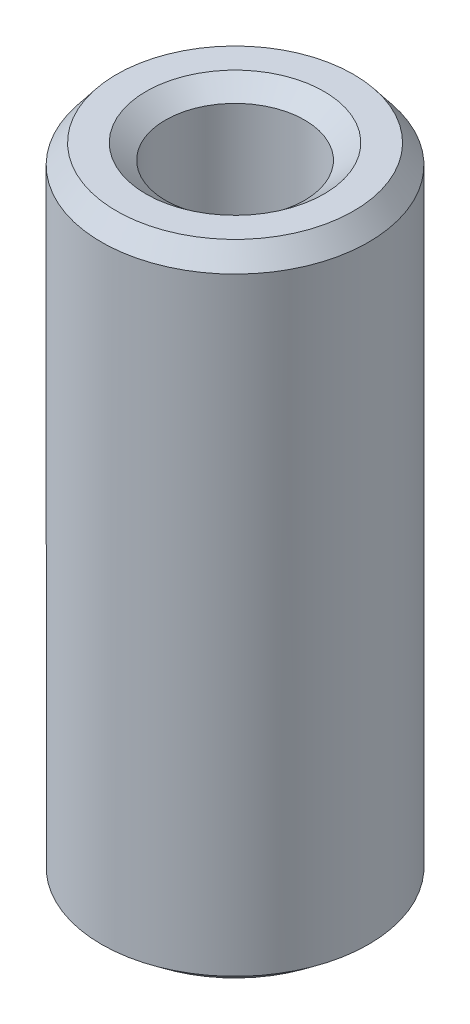
ISO-10303-21;
HEADER;
FILE_DESCRIPTION(('STEP AP214'),'2;1');
FILE_NAME('part.step','',(''),(''),'','','');
FILE_SCHEMA(('AUTOMOTIVE_DESIGN { 1 0 10303 214 1 1 1 1 }'));
ENDSEC;
DATA;
#1=APPLICATION_CONTEXT('core data for automotive mechanical design processes');
#2=APPLICATION_PROTOCOL_DEFINITION('international standard','automotive_design',2000,#1);
#3=PRODUCT_CONTEXT('',#1,'mechanical');
#4=PRODUCT('Part','Part','',(#3));
#5=PRODUCT_RELATED_PRODUCT_CATEGORY('part','',(#4));
#6=PRODUCT_DEFINITION_FORMATION('','',#4);
#7=PRODUCT_DEFINITION_CONTEXT('part definition',#1,'design');
#8=PRODUCT_DEFINITION('design','',#6,#7);
#9=PRODUCT_DEFINITION_SHAPE('','',#8);
#10=(LENGTH_UNIT() NAMED_UNIT(*) SI_UNIT(.MILLI.,.METRE.));
#11=(NAMED_UNIT(*) PLANE_ANGLE_UNIT() SI_UNIT($,.RADIAN.));
#12=(NAMED_UNIT(*) SI_UNIT($,.STERADIAN.) SOLID_ANGLE_UNIT());
#13=UNCERTAINTY_MEASURE_WITH_UNIT(LENGTH_MEASURE(1.E-05),#10,'distance_accuracy_value','');
#14=(GEOMETRIC_REPRESENTATION_CONTEXT(3) GLOBAL_UNCERTAINTY_ASSIGNED_CONTEXT((#13)) GLOBAL_UNIT_ASSIGNED_CONTEXT((#10,
#11,#12)) REPRESENTATION_CONTEXT('',''));
#15=CARTESIAN_POINT('',(0.,0.,0.));
#16=DIRECTION('',(0.,0.,1.));
#17=DIRECTION('',(1.,0.,0.));
#18=AXIS2_PLACEMENT_3D('',#15,#16,#17);
#19=CARTESIAN_POINT('',(0.,60.1337226743174,0.));
#20=DIRECTION('',(0.,-1.,0.));
#21=DIRECTION('',(0.,0.,-1.));
#22=AXIS2_PLACEMENT_3D('',#19,#20,#21);
#23=CYLINDRICAL_SURFACE('',#22,12.5);
#24=CARTESIAN_POINT('',(0.,1.41552789509378,0.));
#25=DIRECTION('',(0.,1.,0.));
#26=DIRECTION('',(0.,0.,1.));
#27=AXIS2_PLACEMENT_3D('',#24,#25,#26);
#28=CIRCLE('',#27,12.5);
#29=CARTESIAN_POINT('',(0.,1.41552789509378,12.5));
#30=VERTEX_POINT('',#29);
#31=EDGE_CURVE('E10',#30,#30,#28,.T.);
#32=ORIENTED_EDGE('',*,*,#31,.T.);
#33=EDGE_LOOP('',(#32));
#34=FACE_BOUND('',#33,.T.);
#35=CARTESIAN_POINT('',(0.,58.3229596717546,0.));
#36=DIRECTION('',(0.,1.,0.));
#37=DIRECTION('',(0.,0.,1.));
#38=AXIS2_PLACEMENT_3D('',#35,#36,#37);
#39=CIRCLE('',#38,12.5);
#40=CARTESIAN_POINT('',(0.,58.3229596717546,-12.5));
#41=VERTEX_POINT('',#40);
#42=EDGE_CURVE('E50',#41,#41,#39,.F.);
#43=ORIENTED_EDGE('',*,*,#42,.T.);
#44=EDGE_LOOP('',(#43));
#45=FACE_BOUND('',#44,.T.);
#46=ADVANCED_FACE('F39',(#34,#45),#23,.T.);
#47=CARTESIAN_POINT('',(0.,60.1337226743174,0.));
#48=DIRECTION('',(0.,1.,0.));
#49=DIRECTION('',(0.,0.,1.));
#50=AXIS2_PLACEMENT_3D('',#47,#48,#49);
#51=PLANE('',#50);
#52=CARTESIAN_POINT('',(0.,60.1337226743174,0.));
#53=DIRECTION('',(0.,1.,0.));
#54=DIRECTION('',(0.,0.,1.));
#55=AXIS2_PLACEMENT_3D('',#52,#53,#54);
#56=CIRCLE('',#55,8.32427591305481);
#57=CARTESIAN_POINT('',(0.,60.1337226743174,8.32427591305481));
#58=VERTEX_POINT('',#57);
#59=EDGE_CURVE('E58',#58,#58,#56,.F.);
#60=ORIENTED_EDGE('',*,*,#59,.T.);
#61=EDGE_LOOP('',(#60));
#62=FACE_BOUND('',#61,.T.);
#63=CARTESIAN_POINT('',(0.,60.1337226743174,0.));
#64=DIRECTION('',(0.,1.,0.));
#65=DIRECTION('',(0.,0.,1.));
#66=AXIS2_PLACEMENT_3D('',#63,#64,#65);
#67=CIRCLE('',#66,11.0844721049062);
#68=CARTESIAN_POINT('',(0.,60.1337226743174,-11.0844721049062));
#69=VERTEX_POINT('',#68);
#70=EDGE_CURVE('E61',#69,#69,#67,.T.);
#71=ORIENTED_EDGE('',*,*,#70,.T.);
#72=EDGE_LOOP('',(#71));
#73=FACE_BOUND('',#72,.T.);
#74=ADVANCED_FACE('F88',(#62,#73),#51,.T.);
#75=CARTESIAN_POINT('',(0.,0.,0.));
#76=DIRECTION('',(0.,1.,0.));
#77=DIRECTION('',(0.,0.,1.));
#78=AXIS2_PLACEMENT_3D('',#75,#76,#77);
#79=PLANE('',#78);
#80=CARTESIAN_POINT('',(0.,0.,0.));
#81=DIRECTION('',(0.,1.,0.));
#82=DIRECTION('',(0.,0.,1.));
#83=AXIS2_PLACEMENT_3D('',#80,#81,#82);
#84=CIRCLE('',#83,7.92904080558578);
#85=CARTESIAN_POINT('',(0.,0.,-7.92904080558578));
#86=VERTEX_POINT('',#85);
#87=EDGE_CURVE('E51',#86,#86,#84,.T.);
#88=ORIENTED_EDGE('',*,*,#87,.T.);
#89=EDGE_LOOP('',(#88));
#90=FACE_BOUND('',#89,.T.);
#91=CARTESIAN_POINT('',(0.,0.,0.));
#92=DIRECTION('',(0.,1.,0.));
#93=DIRECTION('',(0.,0.,1.));
#94=AXIS2_PLACEMENT_3D('',#91,#92,#93);
#95=CIRCLE('',#94,10.6892369974372);
#96=CARTESIAN_POINT('',(0.,0.,10.6892369974372));
#97=VERTEX_POINT('',#96);
#98=EDGE_CURVE('E54',#97,#97,#95,.F.);
#99=ORIENTED_EDGE('',*,*,#98,.T.);
#100=EDGE_LOOP('',(#99));
#101=FACE_BOUND('',#100,.T.);
#102=ADVANCED_FACE('F83',(#90,#101),#79,.F.);
#103=CARTESIAN_POINT('',(0.,60.1337226743174,0.));
#104=DIRECTION('',(0.,-1.,0.));
#105=DIRECTION('',(0.,0.,-1.));
#106=AXIS2_PLACEMENT_3D('',#103,#104,#105);
#107=CYLINDRICAL_SURFACE('',#106,6.513512910492);
#108=CARTESIAN_POINT('',(0.,58.7181947792236,0.));
#109=DIRECTION('',(0.,1.,0.));
#110=DIRECTION('',(0.,0.,1.));
#111=AXIS2_PLACEMENT_3D('',#108,#109,#110);
#112=CIRCLE('',#111,6.513512910492);
#113=CARTESIAN_POINT('',(0.,58.7181947792236,6.513512910492));
#114=VERTEX_POINT('',#113);
#115=EDGE_CURVE('E67',#114,#114,#112,.T.);
#116=ORIENTED_EDGE('',*,*,#115,.T.);
#117=EDGE_LOOP('',(#116));
#118=FACE_BOUND('',#117,.T.);
#119=CARTESIAN_POINT('',(0.,1.81076300256283,0.));
#120=DIRECTION('',(0.,1.,0.));
#121=DIRECTION('',(0.,0.,1.));
#122=AXIS2_PLACEMENT_3D('',#119,#120,#121);
#123=CIRCLE('',#122,6.513512910492);
#124=CARTESIAN_POINT('',(0.,1.81076300256283,-6.513512910492));
#125=VERTEX_POINT('',#124);
#126=EDGE_CURVE('E69',#125,#125,#123,.F.);
#127=ORIENTED_EDGE('',*,*,#126,.T.);
#128=EDGE_LOOP('',(#127));
#129=FACE_BOUND('',#128,.T.);
#130=ADVANCED_FACE('F71',(#118,#129),#107,.F.);
#131=CARTESIAN_POINT('',(0.,58.7181947792236,0.));
#132=DIRECTION('',(0.,1.,0.));
#133=DIRECTION('',(0.,0.,1.));
#134=AXIS2_PLACEMENT_3D('',#131,#132,#133);
#135=CONICAL_SURFACE('',#134,6.513512910492,0.907295286310263);
#136=ORIENTED_EDGE('',*,*,#59,.F.);
#137=EDGE_LOOP('',(#136));
#138=FACE_BOUND('',#137,.T.);
#139=ORIENTED_EDGE('',*,*,#115,.F.);
#140=EDGE_LOOP('',(#139));
#141=FACE_BOUND('',#140,.T.);
#142=ADVANCED_FACE('F77',(#138,#141),#135,.F.);
#143=CARTESIAN_POINT('',(0.,0.,0.));
#144=DIRECTION('',(0.,-1.,0.));
#145=DIRECTION('',(0.,0.,-1.));
#146=AXIS2_PLACEMENT_3D('',#143,#144,#145);
#147=CONICAL_SURFACE('',#146,7.92904080558578,0.663501040484632);
#148=CARTESIAN_POINT('',(0.,1.81076300256283,-6.513512910492));
#149=CARTESIAN_POINT('',(0.,1.7919008879528,-6.52825799273256));
#150=CARTESIAN_POINT('',(0.,1.77303877334277,-6.54300307497312));
#151=CARTESIAN_POINT('',(0.,1.73531454412271,-6.57249323945424));
#152=CARTESIAN_POINT('',(0.,1.71645242951268,-6.5872383216948));
#153=CARTESIAN_POINT('',(0.,1.67872820029263,-6.61672848617592));
#154=CARTESIAN_POINT('',(0.,1.6598660856826,-6.63147356841648));
#155=CARTESIAN_POINT('',(0.,1.62214185646254,-6.6609637328976));
#156=CARTESIAN_POINT('',(0.,1.60327974185251,-6.67570881513816));
#157=CARTESIAN_POINT('',(0.,1.56555551263245,-6.70519897961928));
#158=CARTESIAN_POINT('',(0.,1.54669339802242,-6.71994406185984));
#159=CARTESIAN_POINT('',(0.,1.50896916880236,-6.74943422634096));
#160=CARTESIAN_POINT('',(0.,1.49010705419233,-6.76417930858152));
#161=CARTESIAN_POINT('',(0.,1.45238282497227,-6.79366947306264));
#162=CARTESIAN_POINT('',(0.,1.43352071036224,-6.8084145553032));
#163=CARTESIAN_POINT('',(0.,1.39579648114218,-6.83790471978432));
#164=CARTESIAN_POINT('',(0.,1.37693436653215,-6.85264980202488));
#165=CARTESIAN_POINT('',(0.,1.33921013731209,-6.882139966506));
#166=CARTESIAN_POINT('',(0.,1.32034802270206,-6.89688504874656));
#167=CARTESIAN_POINT('',(0.,1.28262379348201,-6.92637521322768));
#168=CARTESIAN_POINT('',(0.,1.26376167887198,-6.94112029546824));
#169=CARTESIAN_POINT('',(0.,1.22603744965192,-6.97061045994936));
#170=CARTESIAN_POINT('',(0.,1.20717533504189,-6.98535554218992));
#171=CARTESIAN_POINT('',(0.,1.16945110582183,-7.01484570667105));
#172=CARTESIAN_POINT('',(0.,1.1505889912118,-7.02959078891161));
#173=CARTESIAN_POINT('',(0.,1.11286476199174,-7.05908095339273));
#174=CARTESIAN_POINT('',(0.,1.09400264738171,-7.07382603563329));
#175=CARTESIAN_POINT('',(0.,1.05627841816165,-7.10331620011441));
#176=CARTESIAN_POINT('',(0.,1.03741630355162,-7.11806128235497));
#177=CARTESIAN_POINT('',(0.,0.999692074331563,-7.14755144683609));
#178=CARTESIAN_POINT('',(0.,0.980829959721534,-7.16229652907665));
#179=CARTESIAN_POINT('',(0.,0.943105730501475,-7.19178669355777));
#180=CARTESIAN_POINT('',(0.,0.924243615891445,-7.20653177579833));
#181=CARTESIAN_POINT('',(0.,0.886519386671386,-7.23602194027945));
#182=CARTESIAN_POINT('',(0.,0.867657272061357,-7.25076702252001));
#183=CARTESIAN_POINT('',(0.,0.829933042841298,-7.28025718700113));
#184=CARTESIAN_POINT('',(0.,0.811070928231268,-7.29500226924169));
#185=CARTESIAN_POINT('',(0.,0.773346699011209,-7.32449243372281));
#186=CARTESIAN_POINT('',(0.,0.75448458440118,-7.33923751596337));
#187=CARTESIAN_POINT('',(0.,0.716760355181121,-7.36872768044449));
#188=CARTESIAN_POINT('',(0.,0.697898240571091,-7.38347276268505));
#189=CARTESIAN_POINT('',(0.,0.660174011351032,-7.41296292716617));
#190=CARTESIAN_POINT('',(0.,0.641311896741003,-7.42770800940673));
#191=CARTESIAN_POINT('',(0.,0.603587667520944,-7.45719817388785));
#192=CARTESIAN_POINT('',(0.,0.584725552910914,-7.47194325612841));
#193=CARTESIAN_POINT('',(0.,0.547001323690855,-7.50143342060954));
#194=CARTESIAN_POINT('',(0.,0.528139209080826,-7.5161785028501));
#195=CARTESIAN_POINT('',(0.,0.490414979860767,-7.54566866733122));
#196=CARTESIAN_POINT('',(0.,0.471552865250737,-7.56041374957178));
#197=CARTESIAN_POINT('',(0.,0.433828636030678,-7.5899039140529));
#198=CARTESIAN_POINT('',(0.,0.414966521420649,-7.60464899629346));
#199=CARTESIAN_POINT('',(0.,0.37724229220059,-7.63413916077458));
#200=CARTESIAN_POINT('',(0.,0.35838017759056,-7.64888424301514));
#201=CARTESIAN_POINT('',(0.,0.320655948370501,-7.67837440749626));
#202=CARTESIAN_POINT('',(0.,0.301793833760472,-7.69311948973682));
#203=CARTESIAN_POINT('',(0.,0.264069604540413,-7.72260965421794));
#204=CARTESIAN_POINT('',(0.,0.245207489930383,-7.7373547364585));
#205=CARTESIAN_POINT('',(0.,0.207483260710324,-7.76684490093962));
#206=CARTESIAN_POINT('',(0.,0.188621146100295,-7.78158998318018));
#207=CARTESIAN_POINT('',(0.,0.150896916880236,-7.8110801476613));
#208=CARTESIAN_POINT('',(0.,0.132034802270207,-7.82582522990186));
#209=CARTESIAN_POINT('',(0.,0.0943105730501476,-7.85531539438298));
#210=CARTESIAN_POINT('',(0.,0.075448458440118,-7.87006047662354));
#211=CARTESIAN_POINT('',(0.,0.0377242292200587,-7.89955064110466));
#212=CARTESIAN_POINT('',(0.,0.0188621146100291,-7.91429572334522));
#213=CARTESIAN_POINT('',(0.,0.,-7.92904080558578));
#214=B_SPLINE_CURVE_WITH_KNOTS('',3,(#148,#149,#150,#151,#152,#153,#154,#155,#156,#157,#158,
#159,#160,#161,#162,#163,#164,#165,#166,#167,#168,#169,#170,#171,#172,#173,#174,#175,#176,#177,
#178,#179,#180,#181,#182,#183,#184,#185,#186,#187,#188,#189,#190,#191,#192,#193,#194,#195,#196,
#197,#198,#199,#200,#201,#202,#203,#204,#205,#206,#207,#208,#209,#210,#211,#212,#213),
.UNSPECIFIED.,.F.,.F.,(4,2,2,2,2,2,2,2,2,2,2,2,2,2,2,2,2,2,2,2,2,2,2,2,2,2,2,2,2,2,2,2,4),(0.,
0.0718245874376248,0.143649174875249,0.215473762312874,0.287298349750498,0.359122937188123,
0.430947524625748,0.502772112063372,0.574596699500997,0.646421286938621,0.718245874376245,
0.79007046181387,0.861895049251495,0.93371963668912,1.00554422412674,1.07736881156437,
1.14919339900199,1.22101798643962,1.29284257387724,1.36466716131487,1.43649174875249,
1.50831633619012,1.58014092362774,1.65196551106537,1.72379009850299,1.79561468594061,
1.86743927337824,1.93926386081586,2.01108844825349,2.08291303569111,2.15473762312874,
2.22656221056636,2.29838679800399),.UNSPECIFIED.);
#215=EDGE_CURVE('BSEAM73',#125,#86,#214,.T.);
#216=ORIENTED_EDGE('',*,*,#126,.F.);
#217=ORIENTED_EDGE('',*,*,#87,.F.);
#218=ORIENTED_EDGE('',*,*,#215,.T.);
#219=ORIENTED_EDGE('',*,*,#215,.F.);
#220=EDGE_LOOP('',(#216,#218,#217,#219));
#221=FACE_BOUND('',#220,.T.);
#222=ADVANCED_FACE('F73',(#221),#147,.F.);
#223=CARTESIAN_POINT('',(0.,1.41552789509378,0.));
#224=DIRECTION('',(0.,1.,0.));
#225=DIRECTION('',(0.,0.,1.));
#226=AXIS2_PLACEMENT_3D('',#223,#224,#225);
#227=CONICAL_SURFACE('',#226,12.5,0.907295286310264);
#228=ORIENTED_EDGE('',*,*,#98,.F.);
#229=EDGE_LOOP('',(#228));
#230=FACE_BOUND('',#229,.T.);
#231=ORIENTED_EDGE('',*,*,#31,.F.);
#232=EDGE_LOOP('',(#231));
#233=FACE_BOUND('',#232,.T.);
#234=ADVANCED_FACE('F76',(#230,#233),#227,.T.);
#235=CARTESIAN_POINT('',(0.,60.1337226743174,0.));
#236=DIRECTION('',(0.,-1.,0.));
#237=DIRECTION('',(0.,0.,-1.));
#238=AXIS2_PLACEMENT_3D('',#235,#236,#237);
#239=CONICAL_SURFACE('',#238,11.0844721049062,0.663501040484633);
#240=CARTESIAN_POINT('',(0.,58.3229596717546,-12.5));
#241=CARTESIAN_POINT('',(0.,58.3418217863646,-12.4852549177594));
#242=CARTESIAN_POINT('',(0.,58.3606839009746,-12.4705098355189));
#243=CARTESIAN_POINT('',(0.,58.3984081301947,-12.4410196710378));
#244=CARTESIAN_POINT('',(0.,58.4172702448047,-12.4262745887972));
#245=CARTESIAN_POINT('',(0.,58.4549944740248,-12.3967844243161));
#246=CARTESIAN_POINT('',(0.,58.4738565886348,-12.3820393420755));
#247=CARTESIAN_POINT('',(0.,58.5115808178549,-12.3525491775944));
#248=CARTESIAN_POINT('',(0.,58.5304429324649,-12.3378040953538));
#249=CARTESIAN_POINT('',(0.,58.568167161685,-12.3083139308727));
#250=CARTESIAN_POINT('',(0.,58.587029276295,-12.2935688486322));
#251=CARTESIAN_POINT('',(0.,58.6247535055151,-12.264078684151));
#252=CARTESIAN_POINT('',(0.,58.6436156201251,-12.2493336019105));
#253=CARTESIAN_POINT('',(0.,58.6813398493452,-12.2198434374294));
#254=CARTESIAN_POINT('',(0.,58.7002019639552,-12.2050983551888));
#255=CARTESIAN_POINT('',(0.,58.7379261931752,-12.1756081907077));
#256=CARTESIAN_POINT('',(0.,58.7567883077853,-12.1608631084671));
#257=CARTESIAN_POINT('',(0.,58.7945125370053,-12.131372943986));
#258=CARTESIAN_POINT('',(0.,58.8133746516154,-12.1166278617454));
#259=CARTESIAN_POINT('',(0.,58.8510988808354,-12.0871376972643));
#260=CARTESIAN_POINT('',(0.,58.8699609954454,-12.0723926150238));
#261=CARTESIAN_POINT('',(0.,58.9076852246655,-12.0429024505426));
#262=CARTESIAN_POINT('',(0.,58.9265473392755,-12.0281573683021));
#263=CARTESIAN_POINT('',(0.,58.9642715684956,-11.998667203821));
#264=CARTESIAN_POINT('',(0.,58.9831336831056,-11.9839221215804));
#265=CARTESIAN_POINT('',(0.,59.0208579123257,-11.9544319570993));
#266=CARTESIAN_POINT('',(0.,59.0397200269357,-11.9396868748587));
#267=CARTESIAN_POINT('',(0.,59.0774442561558,-11.9101967103776));
#268=CARTESIAN_POINT('',(0.,59.0963063707658,-11.895451628137));
#269=CARTESIAN_POINT('',(0.,59.1340305999859,-11.8659614636559));
#270=CARTESIAN_POINT('',(0.,59.1528927145959,-11.8512163814153));
#271=CARTESIAN_POINT('',(0.,59.1906169438159,-11.8217262169342));
#272=CARTESIAN_POINT('',(0.,59.209479058426,-11.8069811346937));
#273=CARTESIAN_POINT('',(0.,59.247203287646,-11.7774909702125));
#274=CARTESIAN_POINT('',(0.,59.2660654022561,-11.762745887972));
#275=CARTESIAN_POINT('',(0.,59.3037896314761,-11.7332557234909));
#276=CARTESIAN_POINT('',(0.,59.3226517460862,-11.7185106412503));
#277=CARTESIAN_POINT('',(0.,59.3603759753062,-11.6890204767692));
#278=CARTESIAN_POINT('',(0.,59.3792380899162,-11.6742753945286));
#279=CARTESIAN_POINT('',(0.,59.4169623191363,-11.6447852300475));
#280=CARTESIAN_POINT('',(0.,59.4358244337463,-11.6300401478069));
#281=CARTESIAN_POINT('',(0.,59.4735486629664,-11.6005499833258));
#282=CARTESIAN_POINT('',(0.,59.4924107775764,-11.5858049010853));
#283=CARTESIAN_POINT('',(0.,59.5301350067965,-11.5563147366041));
#284=CARTESIAN_POINT('',(0.,59.5489971214065,-11.5415696543636));
#285=CARTESIAN_POINT('',(0.,59.5867213506266,-11.5120794898825));
#286=CARTESIAN_POINT('',(0.,59.6055834652366,-11.4973344076419));
#287=CARTESIAN_POINT('',(0.,59.6433076944567,-11.4678442431608));
#288=CARTESIAN_POINT('',(0.,59.6621698090667,-11.4530991609202));
#289=CARTESIAN_POINT('',(0.,59.6998940382867,-11.4236089964391));
#290=CARTESIAN_POINT('',(0.,59.7187561528968,-11.4088639141985));
#291=CARTESIAN_POINT('',(0.,59.7564803821168,-11.3793737497174));
#292=CARTESIAN_POINT('',(0.,59.7753424967269,-11.3646286674769));
#293=CARTESIAN_POINT('',(0.,59.8130667259469,-11.3351385029957));
#294=CARTESIAN_POINT('',(0.,59.8319288405569,-11.3203934207552));
#295=CARTESIAN_POINT('',(0.,59.869653069777,-11.2909032562741));
#296=CARTESIAN_POINT('',(0.,59.888515184387,-11.2761581740335));
#297=CARTESIAN_POINT('',(0.,59.9262394136071,-11.2466680095524));
#298=CARTESIAN_POINT('',(0.,59.9451015282171,-11.2319229273118));
#299=CARTESIAN_POINT('',(0.,59.9828257574372,-11.2024327628307));
#300=CARTESIAN_POINT('',(0.,60.0016878720472,-11.1876876805901));
#301=CARTESIAN_POINT('',(0.,60.0394121012673,-11.158197516109));
#302=CARTESIAN_POINT('',(0.,60.0582742158773,-11.1434524338685));
#303=CARTESIAN_POINT('',(0.,60.0959984450974,-11.1139622693873));
#304=CARTESIAN_POINT('',(0.,60.1148605597074,-11.0992171871468));
#305=CARTESIAN_POINT('',(0.,60.1337226743174,-11.0844721049062));
#306=B_SPLINE_CURVE_WITH_KNOTS('',3,(#240,#241,#242,#243,#244,#245,#246,#247,#248,#249,#250,
#251,#252,#253,#254,#255,#256,#257,#258,#259,#260,#261,#262,#263,#264,#265,#266,#267,#268,#269,
#270,#271,#272,#273,#274,#275,#276,#277,#278,#279,#280,#281,#282,#283,#284,#285,#286,#287,#288,
#289,#290,#291,#292,#293,#294,#295,#296,#297,#298,#299,#300,#301,#302,#303,#304,#305),
.UNSPECIFIED.,.F.,.F.,(4,2,2,2,2,2,2,2,2,2,2,2,2,2,2,2,2,2,2,2,2,2,2,2,2,2,2,2,2,2,2,2,4),(0.,
0.071824587437629,0.143649174875252,0.215473762312876,0.287298349750499,0.359122937188127,
0.430947524625751,0.502772112063374,0.574596699500998,0.646421286938627,0.718245874376249,
0.790070461813873,0.861895049251496,0.933719636689125,1.00554422412675,1.07736881156437,
1.14919339900199,1.22101798643962,1.29284257387725,1.36466716131487,1.43649174875249,
1.50831633619012,1.58014092362775,1.65196551106537,1.723790098503,1.79561468594062,
1.86743927337825,1.93926386081587,2.0110884482535,2.08291303569112,2.15473762312874,
2.22656221056637,2.298386798004),.UNSPECIFIED.);
#307=EDGE_CURVE('BSEAM45',#41,#69,#306,.T.);
#308=ORIENTED_EDGE('',*,*,#42,.F.);
#309=ORIENTED_EDGE('',*,*,#70,.F.);
#310=ORIENTED_EDGE('',*,*,#307,.T.);
#311=ORIENTED_EDGE('',*,*,#307,.F.);
#312=EDGE_LOOP('',(#308,#310,#309,#311));
#313=FACE_BOUND('',#312,.T.);
#314=ADVANCED_FACE('F45',(#313),#239,.T.);
#315=CLOSED_SHELL('',(#46,#74,#102,#130,#142,#222,#234,#314));
#316=MANIFOLD_SOLID_BREP('B2',#315);
#317=ADVANCED_BREP_SHAPE_REPRESENTATION('',(#18,#316),#14);
#318=SHAPE_DEFINITION_REPRESENTATION(#9,#317);
ENDSEC;
END-ISO-10303-21;
